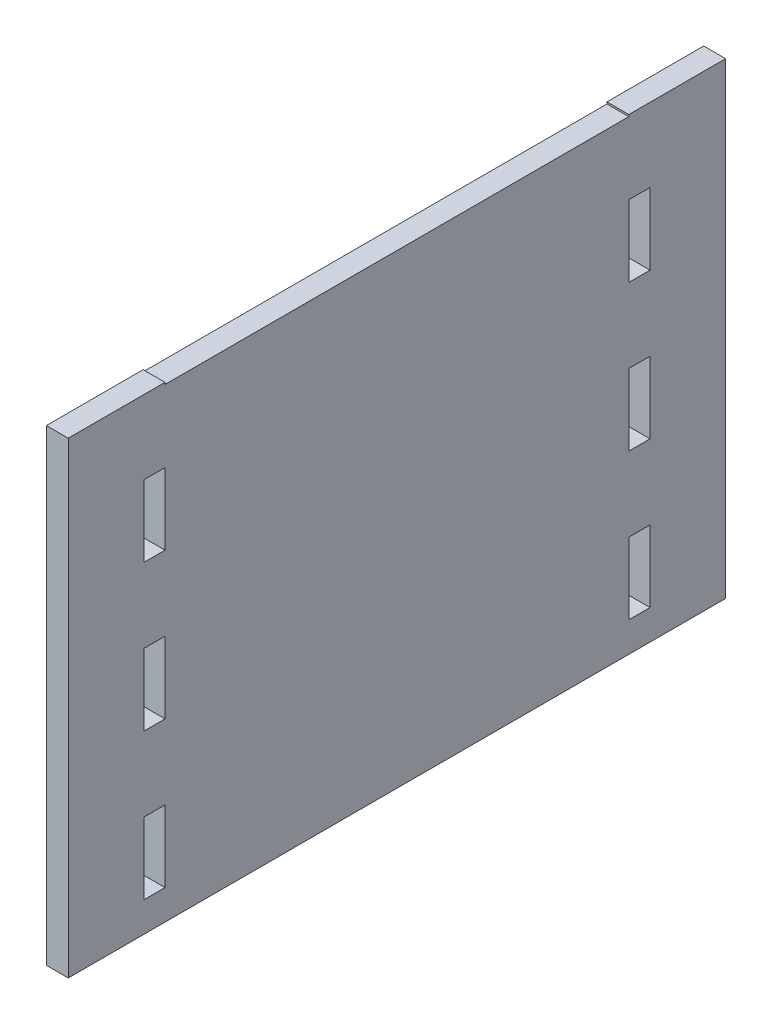
ISO-10303-21;
HEADER;
FILE_DESCRIPTION(('STEP AP214'),'2;1');
FILE_NAME('part.step','',(''),(''),'','','');
FILE_SCHEMA(('AUTOMOTIVE_DESIGN { 1 0 10303 214 1 1 1 1 }'));
ENDSEC;
DATA;
#1=APPLICATION_CONTEXT('core data for automotive mechanical design processes');
#2=APPLICATION_PROTOCOL_DEFINITION('international standard','automotive_design',2000,#1);
#3=PRODUCT_CONTEXT('',#1,'mechanical');
#4=PRODUCT('Part','Part','',(#3));
#5=PRODUCT_RELATED_PRODUCT_CATEGORY('part','',(#4));
#6=PRODUCT_DEFINITION_FORMATION('','',#4);
#7=PRODUCT_DEFINITION_CONTEXT('part definition',#1,'design');
#8=PRODUCT_DEFINITION('design','',#6,#7);
#9=PRODUCT_DEFINITION_SHAPE('','',#8);
#10=(LENGTH_UNIT() NAMED_UNIT(*) SI_UNIT(.MILLI.,.METRE.));
#11=(NAMED_UNIT(*) PLANE_ANGLE_UNIT() SI_UNIT($,.RADIAN.));
#12=(NAMED_UNIT(*) SI_UNIT($,.STERADIAN.) SOLID_ANGLE_UNIT());
#13=UNCERTAINTY_MEASURE_WITH_UNIT(LENGTH_MEASURE(1.E-05),#10,'distance_accuracy_value','');
#14=(GEOMETRIC_REPRESENTATION_CONTEXT(3) GLOBAL_UNCERTAINTY_ASSIGNED_CONTEXT((#13)) GLOBAL_UNIT_ASSIGNED_CONTEXT((#10,
#11,#12)) REPRESENTATION_CONTEXT('',''));
#15=CARTESIAN_POINT('',(0.,0.,0.));
#16=DIRECTION('',(0.,0.,1.));
#17=DIRECTION('',(1.,0.,0.));
#18=AXIS2_PLACEMENT_3D('',#15,#16,#17);
#19=CARTESIAN_POINT('',(3.,32.,-45.));
#20=DIRECTION('',(0.,-1.,0.));
#21=DIRECTION('',(0.,0.,-1.));
#22=AXIS2_PLACEMENT_3D('',#19,#20,#21);
#23=PLANE('',#22);
#24=DIRECTION('',(0.,0.,1.));
#25=VECTOR('',#24,1.);
#26=CARTESIAN_POINT('',(0.,32.,-45.));
#27=LINE('',#26,#25);
#28=CARTESIAN_POINT('',(0.,32.,-45.));
#29=VERTEX_POINT('',#28);
#30=CARTESIAN_POINT('',(0.,32.,-31.75));
#31=VERTEX_POINT('',#30);
#32=EDGE_CURVE('E261',#29,#31,#27,.T.);
#33=ORIENTED_EDGE('',*,*,#32,.T.);
#34=DIRECTION('',(1.,0.,0.));
#35=VECTOR('',#34,1.);
#36=CARTESIAN_POINT('',(-7.,32.,-31.75));
#37=LINE('',#36,#35);
#38=CARTESIAN_POINT('',(3.,32.,-31.75));
#39=VERTEX_POINT('',#38);
#40=EDGE_CURVE('E245',#31,#39,#37,.T.);
#41=ORIENTED_EDGE('',*,*,#40,.T.);
#42=DIRECTION('',(0.,0.,1.));
#43=VECTOR('',#42,1.);
#44=CARTESIAN_POINT('',(3.,32.,-45.));
#45=LINE('',#44,#43);
#46=CARTESIAN_POINT('',(3.,32.,-45.));
#47=VERTEX_POINT('',#46);
#48=EDGE_CURVE('E259',#47,#39,#45,.T.);
#49=ORIENTED_EDGE('',*,*,#48,.F.);
#50=DIRECTION('',(-1.,0.,0.));
#51=VECTOR('',#50,1.);
#52=CARTESIAN_POINT('',(3.,32.,-45.));
#53=LINE('',#52,#51);
#54=EDGE_CURVE('E293',#47,#29,#53,.T.);
#55=ORIENTED_EDGE('',*,*,#54,.T.);
#56=EDGE_LOOP('',(#33,#41,#49,#55));
#57=FACE_BOUND('',#56,.T.);
#58=ADVANCED_FACE('F35',(#57),#23,.F.);
#59=CARTESIAN_POINT('',(3.,-32.,-45.));
#60=DIRECTION('',(0.,-1.,0.));
#61=DIRECTION('',(0.,0.,-1.));
#62=AXIS2_PLACEMENT_3D('',#59,#60,#61);
#63=PLANE('',#62);
#64=DIRECTION('',(0.,0.,1.));
#65=VECTOR('',#64,1.);
#66=CARTESIAN_POINT('',(0.,-32.,-45.));
#67=LINE('',#66,#65);
#68=CARTESIAN_POINT('',(0.,-32.,-45.));
#69=VERTEX_POINT('',#68);
#70=CARTESIAN_POINT('',(0.,-32.,45.));
#71=VERTEX_POINT('',#70);
#72=EDGE_CURVE('E278',#69,#71,#67,.T.);
#73=ORIENTED_EDGE('',*,*,#72,.F.);
#74=DIRECTION('',(-1.,0.,0.));
#75=VECTOR('',#74,1.);
#76=CARTESIAN_POINT('',(3.,-32.,-45.));
#77=LINE('',#76,#75);
#78=CARTESIAN_POINT('',(3.,-32.,-45.));
#79=VERTEX_POINT('',#78);
#80=EDGE_CURVE('E290',#79,#69,#77,.T.);
#81=ORIENTED_EDGE('',*,*,#80,.F.);
#82=DIRECTION('',(0.,0.,1.));
#83=VECTOR('',#82,1.);
#84=CARTESIAN_POINT('',(3.,-32.,-45.));
#85=LINE('',#84,#83);
#86=CARTESIAN_POINT('',(3.,-32.,45.));
#87=VERTEX_POINT('',#86);
#88=EDGE_CURVE('E289',#79,#87,#85,.T.);
#89=ORIENTED_EDGE('',*,*,#88,.T.);
#90=DIRECTION('',(-1.,0.,0.));
#91=VECTOR('',#90,1.);
#92=CARTESIAN_POINT('',(3.,-32.,45.));
#93=LINE('',#92,#91);
#94=EDGE_CURVE('E272',#87,#71,#93,.T.);
#95=ORIENTED_EDGE('',*,*,#94,.T.);
#96=EDGE_LOOP('',(#73,#81,#89,#95));
#97=FACE_BOUND('',#96,.T.);
#98=ADVANCED_FACE('F37',(#97),#63,.T.);
#99=CARTESIAN_POINT('',(3.,-32.,-45.));
#100=DIRECTION('',(0.,0.,1.));
#101=DIRECTION('',(1.,0.,0.));
#102=AXIS2_PLACEMENT_3D('',#99,#100,#101);
#103=PLANE('',#102);
#104=DIRECTION('',(0.,1.,0.));
#105=VECTOR('',#104,1.);
#106=CARTESIAN_POINT('',(0.,-32.,-45.));
#107=LINE('',#106,#105);
#108=EDGE_CURVE('E287',#69,#29,#107,.T.);
#109=ORIENTED_EDGE('',*,*,#108,.T.);
#110=ORIENTED_EDGE('',*,*,#54,.F.);
#111=DIRECTION('',(0.,1.,0.));
#112=VECTOR('',#111,1.);
#113=CARTESIAN_POINT('',(3.,-32.,-45.));
#114=LINE('',#113,#112);
#115=EDGE_CURVE('E268',#79,#47,#114,.T.);
#116=ORIENTED_EDGE('',*,*,#115,.F.);
#117=ORIENTED_EDGE('',*,*,#80,.T.);
#118=EDGE_LOOP('',(#109,#110,#116,#117));
#119=FACE_BOUND('',#118,.T.);
#120=ADVANCED_FACE('F518',(#119),#103,.F.);
#121=CARTESIAN_POINT('',(3.,32.,31.75));
#122=VERTEX_POINT('',#121);
#123=CARTESIAN_POINT('',(3.,32.,45.));
#124=VERTEX_POINT('',#123);
#125=EDGE_CURVE('E270',#122,#124,#45,.T.);
#126=ORIENTED_EDGE('',*,*,#125,.F.);
#127=DIRECTION('',(1.,0.,0.));
#128=VECTOR('',#127,1.);
#129=CARTESIAN_POINT('',(-7.,32.,31.75));
#130=LINE('',#129,#128);
#131=CARTESIAN_POINT('',(0.,32.,31.75));
#132=VERTEX_POINT('',#131);
#133=EDGE_CURVE('E262',#132,#122,#130,.T.);
#134=ORIENTED_EDGE('',*,*,#133,.F.);
#135=CARTESIAN_POINT('',(0.,32.,45.));
#136=VERTEX_POINT('',#135);
#137=EDGE_CURVE('E285',#132,#136,#27,.T.);
#138=ORIENTED_EDGE('',*,*,#137,.T.);
#139=DIRECTION('',(-1.,0.,0.));
#140=VECTOR('',#139,1.);
#141=CARTESIAN_POINT('',(3.,32.,45.));
#142=LINE('',#141,#140);
#143=EDGE_CURVE('E295',#124,#136,#142,.T.);
#144=ORIENTED_EDGE('',*,*,#143,.F.);
#145=EDGE_LOOP('',(#126,#134,#138,#144));
#146=FACE_BOUND('',#145,.T.);
#147=ADVANCED_FACE('F312',(#146),#23,.F.);
#148=CARTESIAN_POINT('',(3.,-32.,45.));
#149=DIRECTION('',(0.,0.,1.));
#150=DIRECTION('',(1.,0.,0.));
#151=AXIS2_PLACEMENT_3D('',#148,#149,#150);
#152=PLANE('',#151);
#153=DIRECTION('',(0.,1.,0.));
#154=VECTOR('',#153,1.);
#155=CARTESIAN_POINT('',(0.,-32.,45.));
#156=LINE('',#155,#154);
#157=EDGE_CURVE('E281',#71,#136,#156,.T.);
#158=ORIENTED_EDGE('',*,*,#157,.F.);
#159=ORIENTED_EDGE('',*,*,#94,.F.);
#160=DIRECTION('',(0.,1.,0.));
#161=VECTOR('',#160,1.);
#162=CARTESIAN_POINT('',(3.,-32.,45.));
#163=LINE('',#162,#161);
#164=EDGE_CURVE('E274',#87,#124,#163,.T.);
#165=ORIENTED_EDGE('',*,*,#164,.T.);
#166=ORIENTED_EDGE('',*,*,#143,.T.);
#167=EDGE_LOOP('',(#158,#159,#165,#166));
#168=FACE_BOUND('',#167,.T.);
#169=ADVANCED_FACE('F512',(#168),#152,.T.);
#170=CARTESIAN_POINT('',(3.,0.,0.));
#171=DIRECTION('',(-1.,0.,0.));
#172=DIRECTION('',(0.,0.,1.));
#173=AXIS2_PLACEMENT_3D('',#170,#171,#172);
#174=PLANE('',#173);
#175=DIRECTION('',(0.,0.,-1.));
#176=VECTOR('',#175,1.);
#177=CARTESIAN_POINT('',(3.,12.1,-31.75));
#178=LINE('',#177,#176);
#179=CARTESIAN_POINT('',(3.,12.1,-31.75));
#180=VERTEX_POINT('',#179);
#181=CARTESIAN_POINT('',(3.,12.1,-34.65));
#182=VERTEX_POINT('',#181);
#183=EDGE_CURVE('E463',#180,#182,#178,.T.);
#184=ORIENTED_EDGE('',*,*,#183,.F.);
#185=DIRECTION('',(0.,-1.,0.));
#186=VECTOR('',#185,1.);
#187=CARTESIAN_POINT('',(3.,21.9,-31.75));
#188=LINE('',#187,#186);
#189=CARTESIAN_POINT('',(3.,21.9,-31.75));
#190=VERTEX_POINT('',#189);
#191=EDGE_CURVE('E58',#190,#180,#188,.T.);
#192=ORIENTED_EDGE('',*,*,#191,.F.);
#193=DIRECTION('',(0.,0.,1.));
#194=VECTOR('',#193,1.);
#195=CARTESIAN_POINT('',(3.,21.9,-31.75));
#196=LINE('',#195,#194);
#197=CARTESIAN_POINT('',(3.,21.9,-34.65));
#198=VERTEX_POINT('',#197);
#199=EDGE_CURVE('E452',#198,#190,#196,.T.);
#200=ORIENTED_EDGE('',*,*,#199,.F.);
#201=DIRECTION('',(0.,1.,0.));
#202=VECTOR('',#201,1.);
#203=CARTESIAN_POINT('',(3.,21.9,-34.65));
#204=LINE('',#203,#202);
#205=EDGE_CURVE('E466',#182,#198,#204,.T.);
#206=ORIENTED_EDGE('',*,*,#205,.F.);
#207=EDGE_LOOP('',(#184,#192,#200,#206));
#208=FACE_BOUND('',#207,.T.);
#209=DIRECTION('',(0.,0.,-1.));
#210=VECTOR('',#209,1.);
#211=CARTESIAN_POINT('',(3.,-7.89999999999999,-31.7499999999998));
#212=LINE('',#211,#210);
#213=CARTESIAN_POINT('',(3.,-7.89999999999999,-31.7499999999998));
#214=VERTEX_POINT('',#213);
#215=CARTESIAN_POINT('',(3.,-7.89999999999999,-34.6499999999998));
#216=VERTEX_POINT('',#215);
#217=EDGE_CURVE('E432',#214,#216,#212,.T.);
#218=ORIENTED_EDGE('',*,*,#217,.F.);
#219=DIRECTION('',(0.,-1.,0.));
#220=VECTOR('',#219,1.);
#221=CARTESIAN_POINT('',(3.,1.90000000000001,-31.7499999999998));
#222=LINE('',#221,#220);
#223=CARTESIAN_POINT('',(3.,1.90000000000001,-31.7499999999998));
#224=VERTEX_POINT('',#223);
#225=EDGE_CURVE('E430',#224,#214,#222,.T.);
#226=ORIENTED_EDGE('',*,*,#225,.F.);
#227=DIRECTION('',(0.,0.,1.));
#228=VECTOR('',#227,1.);
#229=CARTESIAN_POINT('',(3.,1.90000000000001,-31.7499999999998));
#230=LINE('',#229,#228);
#231=CARTESIAN_POINT('',(3.,1.90000000000001,-34.6499999999998));
#232=VERTEX_POINT('',#231);
#233=EDGE_CURVE('E420',#232,#224,#230,.T.);
#234=ORIENTED_EDGE('',*,*,#233,.F.);
#235=DIRECTION('',(0.,1.,0.));
#236=VECTOR('',#235,1.);
#237=CARTESIAN_POINT('',(3.,1.90000000000001,-34.6499999999998));
#238=LINE('',#237,#236);
#239=EDGE_CURVE('E436',#216,#232,#238,.T.);
#240=ORIENTED_EDGE('',*,*,#239,.F.);
#241=EDGE_LOOP('',(#218,#226,#234,#240));
#242=FACE_BOUND('',#241,.T.);
#243=DIRECTION('',(0.,0.,-1.));
#244=VECTOR('',#243,1.);
#245=CARTESIAN_POINT('',(3.,-27.9,-31.7499999999996));
#246=LINE('',#245,#244);
#247=CARTESIAN_POINT('',(3.,-27.9,-31.7499999999996));
#248=VERTEX_POINT('',#247);
#249=CARTESIAN_POINT('',(3.,-27.9,-34.6499999999996));
#250=VERTEX_POINT('',#249);
#251=EDGE_CURVE('E400',#248,#250,#246,.T.);
#252=ORIENTED_EDGE('',*,*,#251,.F.);
#253=DIRECTION('',(0.,-1.,0.));
#254=VECTOR('',#253,1.);
#255=CARTESIAN_POINT('',(3.,-18.1,-31.7499999999996));
#256=LINE('',#255,#254);
#257=CARTESIAN_POINT('',(3.,-18.1,-31.7499999999996));
#258=VERTEX_POINT('',#257);
#259=EDGE_CURVE('E398',#258,#248,#256,.T.);
#260=ORIENTED_EDGE('',*,*,#259,.F.);
#261=DIRECTION('',(0.,0.,1.));
#262=VECTOR('',#261,1.);
#263=CARTESIAN_POINT('',(3.,-18.1,-31.7499999999996));
#264=LINE('',#263,#262);
#265=CARTESIAN_POINT('',(3.,-18.1,-34.6499999999996));
#266=VERTEX_POINT('',#265);
#267=EDGE_CURVE('E388',#266,#258,#264,.T.);
#268=ORIENTED_EDGE('',*,*,#267,.F.);
#269=DIRECTION('',(0.,1.,0.));
#270=VECTOR('',#269,1.);
#271=CARTESIAN_POINT('',(3.,-18.1,-34.6499999999996));
#272=LINE('',#271,#270);
#273=EDGE_CURVE('E404',#250,#266,#272,.T.);
#274=ORIENTED_EDGE('',*,*,#273,.F.);
#275=EDGE_LOOP('',(#252,#260,#268,#274));
#276=FACE_BOUND('',#275,.T.);
#277=DIRECTION('',(0.,-1.,0.));
#278=VECTOR('',#277,1.);
#279=CARTESIAN_POINT('',(3.,-18.1,34.6499999999996));
#280=LINE('',#279,#278);
#281=CARTESIAN_POINT('',(3.,-18.1,34.6499999999996));
#282=VERTEX_POINT('',#281);
#283=CARTESIAN_POINT('',(3.,-27.9,34.6499999999996));
#284=VERTEX_POINT('',#283);
#285=EDGE_CURVE('E368',#282,#284,#280,.T.);
#286=ORIENTED_EDGE('',*,*,#285,.F.);
#287=DIRECTION('',(0.,0.,1.));
#288=VECTOR('',#287,1.);
#289=CARTESIAN_POINT('',(3.,-18.1,31.7499999999996));
#290=LINE('',#289,#288);
#291=CARTESIAN_POINT('',(3.,-18.1,31.7499999999996));
#292=VERTEX_POINT('',#291);
#293=EDGE_CURVE('E366',#292,#282,#290,.T.);
#294=ORIENTED_EDGE('',*,*,#293,.F.);
#295=DIRECTION('',(0.,1.,0.));
#296=VECTOR('',#295,1.);
#297=CARTESIAN_POINT('',(3.,-18.1,31.7499999999996));
#298=LINE('',#297,#296);
#299=CARTESIAN_POINT('',(3.,-27.9,31.7499999999996));
#300=VERTEX_POINT('',#299);
#301=EDGE_CURVE('E356',#300,#292,#298,.T.);
#302=ORIENTED_EDGE('',*,*,#301,.F.);
#303=DIRECTION('',(0.,0.,-1.));
#304=VECTOR('',#303,1.);
#305=CARTESIAN_POINT('',(3.,-27.9,31.7499999999996));
#306=LINE('',#305,#304);
#307=EDGE_CURVE('E372',#284,#300,#306,.T.);
#308=ORIENTED_EDGE('',*,*,#307,.F.);
#309=EDGE_LOOP('',(#286,#294,#302,#308));
#310=FACE_BOUND('',#309,.T.);
#311=DIRECTION('',(0.,-1.,0.));
#312=VECTOR('',#311,1.);
#313=CARTESIAN_POINT('',(3.,1.90000000000001,34.6499999999998));
#314=LINE('',#313,#312);
#315=CARTESIAN_POINT('',(3.,1.90000000000001,34.6499999999998));
#316=VERTEX_POINT('',#315);
#317=CARTESIAN_POINT('',(3.,-7.89999999999999,34.6499999999998));
#318=VERTEX_POINT('',#317);
#319=EDGE_CURVE('E334',#316,#318,#314,.T.);
#320=ORIENTED_EDGE('',*,*,#319,.F.);
#321=DIRECTION('',(0.,0.,1.));
#322=VECTOR('',#321,1.);
#323=CARTESIAN_POINT('',(3.,1.90000000000001,31.7499999999998));
#324=LINE('',#323,#322);
#325=CARTESIAN_POINT('',(3.,1.90000000000001,31.7499999999998));
#326=VERTEX_POINT('',#325);
#327=EDGE_CURVE('E332',#326,#316,#324,.T.);
#328=ORIENTED_EDGE('',*,*,#327,.F.);
#329=DIRECTION('',(0.,1.,0.));
#330=VECTOR('',#329,1.);
#331=CARTESIAN_POINT('',(3.,1.90000000000001,31.7499999999998));
#332=LINE('',#331,#330);
#333=CARTESIAN_POINT('',(3.,-7.89999999999999,31.7499999999998));
#334=VERTEX_POINT('',#333);
#335=EDGE_CURVE('E322',#334,#326,#332,.T.);
#336=ORIENTED_EDGE('',*,*,#335,.F.);
#337=DIRECTION('',(0.,0.,-1.));
#338=VECTOR('',#337,1.);
#339=CARTESIAN_POINT('',(3.,-7.89999999999999,31.7499999999998));
#340=LINE('',#339,#338);
#341=EDGE_CURVE('E338',#318,#334,#340,.T.);
#342=ORIENTED_EDGE('',*,*,#341,.F.);
#343=EDGE_LOOP('',(#320,#328,#336,#342));
#344=FACE_BOUND('',#343,.T.);
#345=DIRECTION('',(0.,0.,1.));
#346=VECTOR('',#345,1.);
#347=CARTESIAN_POINT('',(3.,21.9,31.75));
#348=LINE('',#347,#346);
#349=CARTESIAN_POINT('',(3.,21.9,31.75));
#350=VERTEX_POINT('',#349);
#351=CARTESIAN_POINT('',(3.,21.9,34.65));
#352=VERTEX_POINT('',#351);
#353=EDGE_CURVE('E492',#350,#352,#348,.T.);
#354=ORIENTED_EDGE('',*,*,#353,.F.);
#355=DIRECTION('',(0.,1.,0.));
#356=VECTOR('',#355,1.);
#357=CARTESIAN_POINT('',(3.,21.9,31.75));
#358=LINE('',#357,#356);
#359=CARTESIAN_POINT('',(3.,12.1,31.75));
#360=VERTEX_POINT('',#359);
#361=EDGE_CURVE('E345',#360,#350,#358,.T.);
#362=ORIENTED_EDGE('',*,*,#361,.F.);
#363=DIRECTION('',(0.,0.,-1.));
#364=VECTOR('',#363,1.);
#365=CARTESIAN_POINT('',(3.,12.1,31.75));
#366=LINE('',#365,#364);
#367=CARTESIAN_POINT('',(3.,12.1,34.65));
#368=VERTEX_POINT('',#367);
#369=EDGE_CURVE('E481',#368,#360,#366,.T.);
#370=ORIENTED_EDGE('',*,*,#369,.F.);
#371=DIRECTION('',(0.,-1.,0.));
#372=VECTOR('',#371,1.);
#373=CARTESIAN_POINT('',(3.,21.9,34.65));
#374=LINE('',#373,#372);
#375=EDGE_CURVE('E495',#352,#368,#374,.T.);
#376=ORIENTED_EDGE('',*,*,#375,.F.);
#377=EDGE_LOOP('',(#354,#362,#370,#376));
#378=FACE_BOUND('',#377,.T.);
#379=ORIENTED_EDGE('',*,*,#48,.T.);
#380=DIRECTION('',(0.,1.,0.));
#381=VECTOR('',#380,1.);
#382=CARTESIAN_POINT('',(3.,32.,-31.75));
#383=LINE('',#382,#381);
#384=CARTESIAN_POINT('',(3.,31.75,-31.75));
#385=VERTEX_POINT('',#384);
#386=EDGE_CURVE('E242',#385,#39,#383,.T.);
#387=ORIENTED_EDGE('',*,*,#386,.F.);
#388=DIRECTION('',(0.,0.,-1.));
#389=VECTOR('',#388,1.);
#390=CARTESIAN_POINT('',(3.,31.75,31.75));
#391=LINE('',#390,#389);
#392=CARTESIAN_POINT('',(3.,31.75,31.75));
#393=VERTEX_POINT('',#392);
#394=EDGE_CURVE('E263',#393,#385,#391,.T.);
#395=ORIENTED_EDGE('',*,*,#394,.F.);
#396=DIRECTION('',(0.,-1.,0.));
#397=VECTOR('',#396,1.);
#398=CARTESIAN_POINT('',(3.,32.,31.75));
#399=LINE('',#398,#397);
#400=EDGE_CURVE('E253',#122,#393,#399,.T.);
#401=ORIENTED_EDGE('',*,*,#400,.F.);
#402=ORIENTED_EDGE('',*,*,#125,.T.);
#403=ORIENTED_EDGE('',*,*,#164,.F.);
#404=ORIENTED_EDGE('',*,*,#88,.F.);
#405=ORIENTED_EDGE('',*,*,#115,.T.);
#406=EDGE_LOOP('',(#379,#387,#395,#401,#402,#403,#404,#405));
#407=FACE_BOUND('',#406,.T.);
#408=ADVANCED_FACE('F265',(#208,#242,#276,#310,#344,#378,#407),#174,.F.);
#409=CARTESIAN_POINT('',(0.,0.,0.));
#410=DIRECTION('',(-1.,0.,0.));
#411=DIRECTION('',(0.,0.,1.));
#412=AXIS2_PLACEMENT_3D('',#409,#410,#411);
#413=PLANE('',#412);
#414=DIRECTION('',(0.,-1.,0.));
#415=VECTOR('',#414,1.);
#416=CARTESIAN_POINT('',(0.,0.,-31.75));
#417=LINE('',#416,#415);
#418=CARTESIAN_POINT('',(0.,31.75,-31.75));
#419=VERTEX_POINT('',#418);
#420=EDGE_CURVE('E11',#31,#419,#417,.T.);
#421=ORIENTED_EDGE('',*,*,#420,.F.);
#422=ORIENTED_EDGE('',*,*,#32,.F.);
#423=ORIENTED_EDGE('',*,*,#108,.F.);
#424=ORIENTED_EDGE('',*,*,#72,.T.);
#425=ORIENTED_EDGE('',*,*,#157,.T.);
#426=ORIENTED_EDGE('',*,*,#137,.F.);
#427=DIRECTION('',(0.,1.,0.));
#428=VECTOR('',#427,1.);
#429=CARTESIAN_POINT('',(0.,0.,31.75));
#430=LINE('',#429,#428);
#431=CARTESIAN_POINT('',(0.,31.75,31.75));
#432=VERTEX_POINT('',#431);
#433=EDGE_CURVE('E292',#432,#132,#430,.T.);
#434=ORIENTED_EDGE('',*,*,#433,.F.);
#435=DIRECTION('',(0.,0.,1.));
#436=VECTOR('',#435,1.);
#437=CARTESIAN_POINT('',(0.,31.75,0.));
#438=LINE('',#437,#436);
#439=EDGE_CURVE('E43',#419,#432,#438,.T.);
#440=ORIENTED_EDGE('',*,*,#439,.F.);
#441=EDGE_LOOP('',(#421,#422,#423,#424,#425,#426,#434,#440));
#442=FACE_BOUND('',#441,.T.);
#443=DIRECTION('',(0.,-1.,0.));
#444=VECTOR('',#443,1.);
#445=CARTESIAN_POINT('',(0.,21.9,-31.75));
#446=LINE('',#445,#444);
#447=CARTESIAN_POINT('',(0.,21.9,-31.75));
#448=VERTEX_POINT('',#447);
#449=CARTESIAN_POINT('',(0.,12.1,-31.75));
#450=VERTEX_POINT('',#449);
#451=EDGE_CURVE('E448',#448,#450,#446,.T.);
#452=ORIENTED_EDGE('',*,*,#451,.T.);
#453=DIRECTION('',(0.,0.,-1.));
#454=VECTOR('',#453,1.);
#455=CARTESIAN_POINT('',(0.,12.1,-31.75));
#456=LINE('',#455,#454);
#457=CARTESIAN_POINT('',(0.,12.1,-34.65));
#458=VERTEX_POINT('',#457);
#459=EDGE_CURVE('E451',#450,#458,#456,.T.);
#460=ORIENTED_EDGE('',*,*,#459,.T.);
#461=DIRECTION('',(0.,1.,0.));
#462=VECTOR('',#461,1.);
#463=CARTESIAN_POINT('',(0.,21.9,-34.65));
#464=LINE('',#463,#462);
#465=CARTESIAN_POINT('',(0.,21.9,-34.65));
#466=VERTEX_POINT('',#465);
#467=EDGE_CURVE('E455',#458,#466,#464,.T.);
#468=ORIENTED_EDGE('',*,*,#467,.T.);
#469=DIRECTION('',(0.,0.,1.));
#470=VECTOR('',#469,1.);
#471=CARTESIAN_POINT('',(0.,21.9,-31.75));
#472=LINE('',#471,#470);
#473=EDGE_CURVE('E458',#466,#448,#472,.T.);
#474=ORIENTED_EDGE('',*,*,#473,.T.);
#475=EDGE_LOOP('',(#452,#460,#468,#474));
#476=FACE_BOUND('',#475,.T.);
#477=DIRECTION('',(0.,-1.,0.));
#478=VECTOR('',#477,1.);
#479=CARTESIAN_POINT('',(0.,1.90000000000001,-31.7499999999998));
#480=LINE('',#479,#478);
#481=CARTESIAN_POINT('',(0.,1.90000000000001,-31.7499999999998));
#482=VERTEX_POINT('',#481);
#483=CARTESIAN_POINT('',(0.,-7.89999999999999,-31.7499999999998));
#484=VERTEX_POINT('',#483);
#485=EDGE_CURVE('E416',#482,#484,#480,.T.);
#486=ORIENTED_EDGE('',*,*,#485,.T.);
#487=DIRECTION('',(0.,0.,-1.));
#488=VECTOR('',#487,1.);
#489=CARTESIAN_POINT('',(0.,-7.89999999999999,-31.7499999999998));
#490=LINE('',#489,#488);
#491=CARTESIAN_POINT('',(0.,-7.89999999999999,-34.6499999999998));
#492=VERTEX_POINT('',#491);
#493=EDGE_CURVE('E419',#484,#492,#490,.T.);
#494=ORIENTED_EDGE('',*,*,#493,.T.);
#495=DIRECTION('',(0.,1.,0.));
#496=VECTOR('',#495,1.);
#497=CARTESIAN_POINT('',(0.,1.90000000000001,-34.6499999999998));
#498=LINE('',#497,#496);
#499=CARTESIAN_POINT('',(0.,1.90000000000001,-34.6499999999998));
#500=VERTEX_POINT('',#499);
#501=EDGE_CURVE('E423',#492,#500,#498,.T.);
#502=ORIENTED_EDGE('',*,*,#501,.T.);
#503=DIRECTION('',(0.,0.,1.));
#504=VECTOR('',#503,1.);
#505=CARTESIAN_POINT('',(0.,1.90000000000001,-31.7499999999998));
#506=LINE('',#505,#504);
#507=EDGE_CURVE('E426',#500,#482,#506,.T.);
#508=ORIENTED_EDGE('',*,*,#507,.T.);
#509=EDGE_LOOP('',(#486,#494,#502,#508));
#510=FACE_BOUND('',#509,.T.);
#511=DIRECTION('',(0.,-1.,0.));
#512=VECTOR('',#511,1.);
#513=CARTESIAN_POINT('',(0.,-18.1,-31.7499999999996));
#514=LINE('',#513,#512);
#515=CARTESIAN_POINT('',(0.,-18.1,-31.7499999999996));
#516=VERTEX_POINT('',#515);
#517=CARTESIAN_POINT('',(0.,-27.9,-31.7499999999996));
#518=VERTEX_POINT('',#517);
#519=EDGE_CURVE('E384',#516,#518,#514,.T.);
#520=ORIENTED_EDGE('',*,*,#519,.T.);
#521=DIRECTION('',(0.,0.,-1.));
#522=VECTOR('',#521,1.);
#523=CARTESIAN_POINT('',(0.,-27.9,-31.7499999999996));
#524=LINE('',#523,#522);
#525=CARTESIAN_POINT('',(0.,-27.9,-34.6499999999996));
#526=VERTEX_POINT('',#525);
#527=EDGE_CURVE('E387',#518,#526,#524,.T.);
#528=ORIENTED_EDGE('',*,*,#527,.T.);
#529=DIRECTION('',(0.,1.,0.));
#530=VECTOR('',#529,1.);
#531=CARTESIAN_POINT('',(0.,-18.1,-34.6499999999996));
#532=LINE('',#531,#530);
#533=CARTESIAN_POINT('',(0.,-18.1,-34.6499999999996));
#534=VERTEX_POINT('',#533);
#535=EDGE_CURVE('E391',#526,#534,#532,.T.);
#536=ORIENTED_EDGE('',*,*,#535,.T.);
#537=DIRECTION('',(0.,0.,1.));
#538=VECTOR('',#537,1.);
#539=CARTESIAN_POINT('',(0.,-18.1,-31.7499999999996));
#540=LINE('',#539,#538);
#541=EDGE_CURVE('E394',#534,#516,#540,.T.);
#542=ORIENTED_EDGE('',*,*,#541,.T.);
#543=EDGE_LOOP('',(#520,#528,#536,#542));
#544=FACE_BOUND('',#543,.T.);
#545=DIRECTION('',(0.,0.,1.));
#546=VECTOR('',#545,1.);
#547=CARTESIAN_POINT('',(0.,-18.1,31.7499999999996));
#548=LINE('',#547,#546);
#549=CARTESIAN_POINT('',(0.,-18.1,31.7499999999996));
#550=VERTEX_POINT('',#549);
#551=CARTESIAN_POINT('',(0.,-18.1,34.6499999999996));
#552=VERTEX_POINT('',#551);
#553=EDGE_CURVE('E352',#550,#552,#548,.T.);
#554=ORIENTED_EDGE('',*,*,#553,.T.);
#555=DIRECTION('',(0.,-1.,0.));
#556=VECTOR('',#555,1.);
#557=CARTESIAN_POINT('',(0.,-18.1,34.6499999999996));
#558=LINE('',#557,#556);
#559=CARTESIAN_POINT('',(0.,-27.9,34.6499999999996));
#560=VERTEX_POINT('',#559);
#561=EDGE_CURVE('E355',#552,#560,#558,.T.);
#562=ORIENTED_EDGE('',*,*,#561,.T.);
#563=DIRECTION('',(0.,0.,-1.));
#564=VECTOR('',#563,1.);
#565=CARTESIAN_POINT('',(0.,-27.9,31.7499999999996));
#566=LINE('',#565,#564);
#567=CARTESIAN_POINT('',(0.,-27.9,31.7499999999996));
#568=VERTEX_POINT('',#567);
#569=EDGE_CURVE('E359',#560,#568,#566,.T.);
#570=ORIENTED_EDGE('',*,*,#569,.T.);
#571=DIRECTION('',(0.,1.,0.));
#572=VECTOR('',#571,1.);
#573=CARTESIAN_POINT('',(0.,-18.1,31.7499999999996));
#574=LINE('',#573,#572);
#575=EDGE_CURVE('E362',#568,#550,#574,.T.);
#576=ORIENTED_EDGE('',*,*,#575,.T.);
#577=EDGE_LOOP('',(#554,#562,#570,#576));
#578=FACE_BOUND('',#577,.T.);
#579=DIRECTION('',(0.,0.,1.));
#580=VECTOR('',#579,1.);
#581=CARTESIAN_POINT('',(0.,1.90000000000001,31.7499999999998));
#582=LINE('',#581,#580);
#583=CARTESIAN_POINT('',(0.,1.90000000000001,31.7499999999998));
#584=VERTEX_POINT('',#583);
#585=CARTESIAN_POINT('',(0.,1.90000000000001,34.6499999999998));
#586=VERTEX_POINT('',#585);
#587=EDGE_CURVE('E318',#584,#586,#582,.T.);
#588=ORIENTED_EDGE('',*,*,#587,.T.);
#589=DIRECTION('',(0.,-1.,0.));
#590=VECTOR('',#589,1.);
#591=CARTESIAN_POINT('',(0.,1.90000000000001,34.6499999999998));
#592=LINE('',#591,#590);
#593=CARTESIAN_POINT('',(0.,-7.89999999999999,34.6499999999998));
#594=VERTEX_POINT('',#593);
#595=EDGE_CURVE('E321',#586,#594,#592,.T.);
#596=ORIENTED_EDGE('',*,*,#595,.T.);
#597=DIRECTION('',(0.,0.,-1.));
#598=VECTOR('',#597,1.);
#599=CARTESIAN_POINT('',(0.,-7.89999999999999,31.7499999999998));
#600=LINE('',#599,#598);
#601=CARTESIAN_POINT('',(0.,-7.89999999999999,31.7499999999998));
#602=VERTEX_POINT('',#601);
#603=EDGE_CURVE('E325',#594,#602,#600,.T.);
#604=ORIENTED_EDGE('',*,*,#603,.T.);
#605=DIRECTION('',(0.,1.,0.));
#606=VECTOR('',#605,1.);
#607=CARTESIAN_POINT('',(0.,1.90000000000001,31.7499999999998));
#608=LINE('',#607,#606);
#609=EDGE_CURVE('E328',#602,#584,#608,.T.);
#610=ORIENTED_EDGE('',*,*,#609,.T.);
#611=EDGE_LOOP('',(#588,#596,#604,#610));
#612=FACE_BOUND('',#611,.T.);
#613=DIRECTION('',(0.,1.,0.));
#614=VECTOR('',#613,1.);
#615=CARTESIAN_POINT('',(0.,21.9,31.75));
#616=LINE('',#615,#614);
#617=CARTESIAN_POINT('',(0.,12.1,31.75));
#618=VERTEX_POINT('',#617);
#619=CARTESIAN_POINT('',(0.,21.9,31.75));
#620=VERTEX_POINT('',#619);
#621=EDGE_CURVE('E477',#618,#620,#616,.T.);
#622=ORIENTED_EDGE('',*,*,#621,.T.);
#623=DIRECTION('',(0.,0.,1.));
#624=VECTOR('',#623,1.);
#625=CARTESIAN_POINT('',(0.,21.9,31.75));
#626=LINE('',#625,#624);
#627=CARTESIAN_POINT('',(0.,21.9,34.65));
#628=VERTEX_POINT('',#627);
#629=EDGE_CURVE('E480',#620,#628,#626,.T.);
#630=ORIENTED_EDGE('',*,*,#629,.T.);
#631=DIRECTION('',(0.,-1.,0.));
#632=VECTOR('',#631,1.);
#633=CARTESIAN_POINT('',(0.,21.9,34.65));
#634=LINE('',#633,#632);
#635=CARTESIAN_POINT('',(0.,12.1,34.65));
#636=VERTEX_POINT('',#635);
#637=EDGE_CURVE('E484',#628,#636,#634,.T.);
#638=ORIENTED_EDGE('',*,*,#637,.T.);
#639=DIRECTION('',(0.,0.,-1.));
#640=VECTOR('',#639,1.);
#641=CARTESIAN_POINT('',(0.,12.1,31.75));
#642=LINE('',#641,#640);
#643=EDGE_CURVE('E487',#636,#618,#642,.T.);
#644=ORIENTED_EDGE('',*,*,#643,.T.);
#645=EDGE_LOOP('',(#622,#630,#638,#644));
#646=FACE_BOUND('',#645,.T.);
#647=ADVANCED_FACE('F305',(#442,#476,#510,#544,#578,#612,#646),#413,.T.);
#648=CARTESIAN_POINT('',(0.,21.9,31.75));
#649=DIRECTION('',(0.,0.,-1.));
#650=DIRECTION('',(-1.,0.,0.));
#651=AXIS2_PLACEMENT_3D('',#648,#649,#650);
#652=PLANE('',#651);
#653=ORIENTED_EDGE('',*,*,#361,.T.);
#654=DIRECTION('',(1.,0.,0.));
#655=VECTOR('',#654,1.);
#656=CARTESIAN_POINT('',(0.,21.9,31.75));
#657=LINE('',#656,#655);
#658=EDGE_CURVE('E490',#620,#350,#657,.T.);
#659=ORIENTED_EDGE('',*,*,#658,.F.);
#660=ORIENTED_EDGE('',*,*,#621,.F.);
#661=DIRECTION('',(1.,0.,0.));
#662=VECTOR('',#661,1.);
#663=CARTESIAN_POINT('',(0.,12.1,31.75));
#664=LINE('',#663,#662);
#665=EDGE_CURVE('E282',#618,#360,#664,.T.);
#666=ORIENTED_EDGE('',*,*,#665,.T.);
#667=EDGE_LOOP('',(#653,#659,#660,#666));
#668=FACE_BOUND('',#667,.T.);
#669=ADVANCED_FACE('F539',(#668),#652,.F.);
#670=CARTESIAN_POINT('',(0.,12.1,31.75));
#671=DIRECTION('',(0.,-1.,0.));
#672=DIRECTION('',(0.,0.,-1.));
#673=AXIS2_PLACEMENT_3D('',#670,#671,#672);
#674=PLANE('',#673);
#675=ORIENTED_EDGE('',*,*,#369,.T.);
#676=ORIENTED_EDGE('',*,*,#665,.F.);
#677=ORIENTED_EDGE('',*,*,#643,.F.);
#678=DIRECTION('',(1.,0.,0.));
#679=VECTOR('',#678,1.);
#680=CARTESIAN_POINT('',(0.,12.1,34.65));
#681=LINE('',#680,#679);
#682=EDGE_CURVE('E501',#636,#368,#681,.T.);
#683=ORIENTED_EDGE('',*,*,#682,.T.);
#684=EDGE_LOOP('',(#675,#676,#677,#683));
#685=FACE_BOUND('',#684,.T.);
#686=ADVANCED_FACE('F545',(#685),#674,.F.);
#687=CARTESIAN_POINT('',(0.,21.9,34.65));
#688=DIRECTION('',(0.,0.,1.));
#689=DIRECTION('',(1.,0.,0.));
#690=AXIS2_PLACEMENT_3D('',#687,#688,#689);
#691=PLANE('',#690);
#692=ORIENTED_EDGE('',*,*,#375,.T.);
#693=ORIENTED_EDGE('',*,*,#682,.F.);
#694=ORIENTED_EDGE('',*,*,#637,.F.);
#695=DIRECTION('',(1.,0.,0.));
#696=VECTOR('',#695,1.);
#697=CARTESIAN_POINT('',(0.,21.9,34.65));
#698=LINE('',#697,#696);
#699=EDGE_CURVE('E503',#628,#352,#698,.T.);
#700=ORIENTED_EDGE('',*,*,#699,.T.);
#701=EDGE_LOOP('',(#692,#693,#694,#700));
#702=FACE_BOUND('',#701,.T.);
#703=ADVANCED_FACE('F551',(#702),#691,.F.);
#704=CARTESIAN_POINT('',(0.,21.9,31.75));
#705=DIRECTION('',(0.,1.,0.));
#706=DIRECTION('',(0.,0.,1.));
#707=AXIS2_PLACEMENT_3D('',#704,#705,#706);
#708=PLANE('',#707);
#709=ORIENTED_EDGE('',*,*,#353,.T.);
#710=ORIENTED_EDGE('',*,*,#699,.F.);
#711=ORIENTED_EDGE('',*,*,#629,.F.);
#712=ORIENTED_EDGE('',*,*,#658,.T.);
#713=EDGE_LOOP('',(#709,#710,#711,#712));
#714=FACE_BOUND('',#713,.T.);
#715=ADVANCED_FACE('F547',(#714),#708,.F.);
#716=CARTESIAN_POINT('',(0.,1.90000000000001,31.7499999999998));
#717=DIRECTION('',(0.,1.,0.));
#718=DIRECTION('',(0.,0.,1.));
#719=AXIS2_PLACEMENT_3D('',#716,#717,#718);
#720=PLANE('',#719);
#721=ORIENTED_EDGE('',*,*,#327,.T.);
#722=DIRECTION('',(1.,0.,0.));
#723=VECTOR('',#722,1.);
#724=CARTESIAN_POINT('',(0.,1.90000000000001,34.6499999999998));
#725=LINE('',#724,#723);
#726=EDGE_CURVE('E331',#586,#316,#725,.T.);
#727=ORIENTED_EDGE('',*,*,#726,.F.);
#728=ORIENTED_EDGE('',*,*,#587,.F.);
#729=DIRECTION('',(1.,0.,0.));
#730=VECTOR('',#729,1.);
#731=CARTESIAN_POINT('',(0.,1.90000000000001,31.7499999999998));
#732=LINE('',#731,#730);
#733=EDGE_CURVE('E343',#584,#326,#732,.T.);
#734=ORIENTED_EDGE('',*,*,#733,.T.);
#735=EDGE_LOOP('',(#721,#727,#728,#734));
#736=FACE_BOUND('',#735,.T.);
#737=ADVANCED_FACE('F550',(#736),#720,.F.);
#738=CARTESIAN_POINT('',(0.,1.90000000000001,31.7499999999998));
#739=DIRECTION('',(0.,0.,-1.));
#740=DIRECTION('',(-1.,0.,0.));
#741=AXIS2_PLACEMENT_3D('',#738,#739,#740);
#742=PLANE('',#741);
#743=ORIENTED_EDGE('',*,*,#335,.T.);
#744=ORIENTED_EDGE('',*,*,#733,.F.);
#745=ORIENTED_EDGE('',*,*,#609,.F.);
#746=DIRECTION('',(1.,0.,0.));
#747=VECTOR('',#746,1.);
#748=CARTESIAN_POINT('',(0.,-7.89999999999999,31.7499999999998));
#749=LINE('',#748,#747);
#750=EDGE_CURVE('E346',#602,#334,#749,.T.);
#751=ORIENTED_EDGE('',*,*,#750,.T.);
#752=EDGE_LOOP('',(#743,#744,#745,#751));
#753=FACE_BOUND('',#752,.T.);
#754=ADVANCED_FACE('F625',(#753),#742,.F.);
#755=CARTESIAN_POINT('',(0.,-7.89999999999999,31.7499999999998));
#756=DIRECTION('',(0.,-1.,0.));
#757=DIRECTION('',(0.,0.,-1.));
#758=AXIS2_PLACEMENT_3D('',#755,#756,#757);
#759=PLANE('',#758);
#760=ORIENTED_EDGE('',*,*,#341,.T.);
#761=ORIENTED_EDGE('',*,*,#750,.F.);
#762=ORIENTED_EDGE('',*,*,#603,.F.);
#763=DIRECTION('',(1.,0.,0.));
#764=VECTOR('',#763,1.);
#765=CARTESIAN_POINT('',(0.,-7.89999999999999,34.6499999999998));
#766=LINE('',#765,#764);
#767=EDGE_CURVE('E348',#594,#318,#766,.T.);
#768=ORIENTED_EDGE('',*,*,#767,.T.);
#769=EDGE_LOOP('',(#760,#761,#762,#768));
#770=FACE_BOUND('',#769,.T.);
#771=ADVANCED_FACE('F629',(#770),#759,.F.);
#772=CARTESIAN_POINT('',(0.,1.90000000000001,34.6499999999998));
#773=DIRECTION('',(0.,0.,1.));
#774=DIRECTION('',(1.,0.,0.));
#775=AXIS2_PLACEMENT_3D('',#772,#773,#774);
#776=PLANE('',#775);
#777=ORIENTED_EDGE('',*,*,#319,.T.);
#778=ORIENTED_EDGE('',*,*,#767,.F.);
#779=ORIENTED_EDGE('',*,*,#595,.F.);
#780=ORIENTED_EDGE('',*,*,#726,.T.);
#781=EDGE_LOOP('',(#777,#778,#779,#780));
#782=FACE_BOUND('',#781,.T.);
#783=ADVANCED_FACE('F611',(#782),#776,.F.);
#784=CARTESIAN_POINT('',(0.,-18.1,31.7499999999996));
#785=DIRECTION('',(0.,1.,0.));
#786=DIRECTION('',(0.,0.,1.));
#787=AXIS2_PLACEMENT_3D('',#784,#785,#786);
#788=PLANE('',#787);
#789=ORIENTED_EDGE('',*,*,#293,.T.);
#790=DIRECTION('',(1.,0.,0.));
#791=VECTOR('',#790,1.);
#792=CARTESIAN_POINT('',(0.,-18.1,34.6499999999996));
#793=LINE('',#792,#791);
#794=EDGE_CURVE('E365',#552,#282,#793,.T.);
#795=ORIENTED_EDGE('',*,*,#794,.F.);
#796=ORIENTED_EDGE('',*,*,#553,.F.);
#797=DIRECTION('',(1.,0.,0.));
#798=VECTOR('',#797,1.);
#799=CARTESIAN_POINT('',(0.,-18.1,31.7499999999996));
#800=LINE('',#799,#798);
#801=EDGE_CURVE('E335',#550,#292,#800,.T.);
#802=ORIENTED_EDGE('',*,*,#801,.T.);
#803=EDGE_LOOP('',(#789,#795,#796,#802));
#804=FACE_BOUND('',#803,.T.);
#805=ADVANCED_FACE('F607',(#804),#788,.F.);
#806=CARTESIAN_POINT('',(0.,-18.1,31.7499999999996));
#807=DIRECTION('',(0.,0.,-1.));
#808=DIRECTION('',(-1.,0.,0.));
#809=AXIS2_PLACEMENT_3D('',#806,#807,#808);
#810=PLANE('',#809);
#811=ORIENTED_EDGE('',*,*,#301,.T.);
#812=ORIENTED_EDGE('',*,*,#801,.F.);
#813=ORIENTED_EDGE('',*,*,#575,.F.);
#814=DIRECTION('',(1.,0.,0.));
#815=VECTOR('',#814,1.);
#816=CARTESIAN_POINT('',(0.,-27.9,31.7499999999996));
#817=LINE('',#816,#815);
#818=EDGE_CURVE('E378',#568,#300,#817,.T.);
#819=ORIENTED_EDGE('',*,*,#818,.T.);
#820=EDGE_LOOP('',(#811,#812,#813,#819));
#821=FACE_BOUND('',#820,.T.);
#822=ADVANCED_FACE('F610',(#821),#810,.F.);
#823=CARTESIAN_POINT('',(0.,-27.9,31.7499999999996));
#824=DIRECTION('',(0.,-1.,0.));
#825=DIRECTION('',(0.,0.,-1.));
#826=AXIS2_PLACEMENT_3D('',#823,#824,#825);
#827=PLANE('',#826);
#828=ORIENTED_EDGE('',*,*,#307,.T.);
#829=ORIENTED_EDGE('',*,*,#818,.F.);
#830=ORIENTED_EDGE('',*,*,#569,.F.);
#831=DIRECTION('',(1.,0.,0.));
#832=VECTOR('',#831,1.);
#833=CARTESIAN_POINT('',(0.,-27.9,34.6499999999996));
#834=LINE('',#833,#832);
#835=EDGE_CURVE('E380',#560,#284,#834,.T.);
#836=ORIENTED_EDGE('',*,*,#835,.T.);
#837=EDGE_LOOP('',(#828,#829,#830,#836));
#838=FACE_BOUND('',#837,.T.);
#839=ADVANCED_FACE('F615',(#838),#827,.F.);
#840=CARTESIAN_POINT('',(0.,-18.1,34.6499999999996));
#841=DIRECTION('',(0.,0.,1.));
#842=DIRECTION('',(1.,0.,0.));
#843=AXIS2_PLACEMENT_3D('',#840,#841,#842);
#844=PLANE('',#843);
#845=ORIENTED_EDGE('',*,*,#285,.T.);
#846=ORIENTED_EDGE('',*,*,#835,.F.);
#847=ORIENTED_EDGE('',*,*,#561,.F.);
#848=ORIENTED_EDGE('',*,*,#794,.T.);
#849=EDGE_LOOP('',(#845,#846,#847,#848));
#850=FACE_BOUND('',#849,.T.);
#851=ADVANCED_FACE('F595',(#850),#844,.F.);
#852=CARTESIAN_POINT('',(0.,-18.1,-31.7499999999996));
#853=DIRECTION('',(0.,0.,1.));
#854=DIRECTION('',(1.,0.,0.));
#855=AXIS2_PLACEMENT_3D('',#852,#853,#854);
#856=PLANE('',#855);
#857=ORIENTED_EDGE('',*,*,#259,.T.);
#858=DIRECTION('',(1.,0.,0.));
#859=VECTOR('',#858,1.);
#860=CARTESIAN_POINT('',(0.,-27.9,-31.7499999999996));
#861=LINE('',#860,#859);
#862=EDGE_CURVE('E397',#518,#248,#861,.T.);
#863=ORIENTED_EDGE('',*,*,#862,.F.);
#864=ORIENTED_EDGE('',*,*,#519,.F.);
#865=DIRECTION('',(1.,0.,0.));
#866=VECTOR('',#865,1.);
#867=CARTESIAN_POINT('',(0.,-18.1,-31.7499999999996));
#868=LINE('',#867,#866);
#869=EDGE_CURVE('E369',#516,#258,#868,.T.);
#870=ORIENTED_EDGE('',*,*,#869,.T.);
#871=EDGE_LOOP('',(#857,#863,#864,#870));
#872=FACE_BOUND('',#871,.T.);
#873=ADVANCED_FACE('F591',(#872),#856,.F.);
#874=CARTESIAN_POINT('',(0.,-18.1,-31.7499999999996));
#875=DIRECTION('',(0.,1.,0.));
#876=DIRECTION('',(0.,0.,1.));
#877=AXIS2_PLACEMENT_3D('',#874,#875,#876);
#878=PLANE('',#877);
#879=ORIENTED_EDGE('',*,*,#267,.T.);
#880=ORIENTED_EDGE('',*,*,#869,.F.);
#881=ORIENTED_EDGE('',*,*,#541,.F.);
#882=DIRECTION('',(1.,0.,0.));
#883=VECTOR('',#882,1.);
#884=CARTESIAN_POINT('',(0.,-18.1,-34.6499999999996));
#885=LINE('',#884,#883);
#886=EDGE_CURVE('E410',#534,#266,#885,.T.);
#887=ORIENTED_EDGE('',*,*,#886,.T.);
#888=EDGE_LOOP('',(#879,#880,#881,#887));
#889=FACE_BOUND('',#888,.T.);
#890=ADVANCED_FACE('F594',(#889),#878,.F.);
#891=CARTESIAN_POINT('',(0.,-18.1,-34.6499999999996));
#892=DIRECTION('',(0.,0.,-1.));
#893=DIRECTION('',(-1.,0.,0.));
#894=AXIS2_PLACEMENT_3D('',#891,#892,#893);
#895=PLANE('',#894);
#896=ORIENTED_EDGE('',*,*,#273,.T.);
#897=ORIENTED_EDGE('',*,*,#886,.F.);
#898=ORIENTED_EDGE('',*,*,#535,.F.);
#899=DIRECTION('',(1.,0.,0.));
#900=VECTOR('',#899,1.);
#901=CARTESIAN_POINT('',(0.,-27.9,-34.6499999999996));
#902=LINE('',#901,#900);
#903=EDGE_CURVE('E412',#526,#250,#902,.T.);
#904=ORIENTED_EDGE('',*,*,#903,.T.);
#905=EDGE_LOOP('',(#896,#897,#898,#904));
#906=FACE_BOUND('',#905,.T.);
#907=ADVANCED_FACE('F599',(#906),#895,.F.);
#908=CARTESIAN_POINT('',(0.,-27.9,-31.7499999999996));
#909=DIRECTION('',(0.,-1.,0.));
#910=DIRECTION('',(0.,0.,-1.));
#911=AXIS2_PLACEMENT_3D('',#908,#909,#910);
#912=PLANE('',#911);
#913=ORIENTED_EDGE('',*,*,#251,.T.);
#914=ORIENTED_EDGE('',*,*,#903,.F.);
#915=ORIENTED_EDGE('',*,*,#527,.F.);
#916=ORIENTED_EDGE('',*,*,#862,.T.);
#917=EDGE_LOOP('',(#913,#914,#915,#916));
#918=FACE_BOUND('',#917,.T.);
#919=ADVANCED_FACE('F579',(#918),#912,.F.);
#920=CARTESIAN_POINT('',(0.,1.90000000000001,-31.7499999999998));
#921=DIRECTION('',(0.,0.,1.));
#922=DIRECTION('',(1.,0.,0.));
#923=AXIS2_PLACEMENT_3D('',#920,#921,#922);
#924=PLANE('',#923);
#925=ORIENTED_EDGE('',*,*,#225,.T.);
#926=DIRECTION('',(1.,0.,0.));
#927=VECTOR('',#926,1.);
#928=CARTESIAN_POINT('',(0.,-7.89999999999999,-31.7499999999998));
#929=LINE('',#928,#927);
#930=EDGE_CURVE('E429',#484,#214,#929,.T.);
#931=ORIENTED_EDGE('',*,*,#930,.F.);
#932=ORIENTED_EDGE('',*,*,#485,.F.);
#933=DIRECTION('',(1.,0.,0.));
#934=VECTOR('',#933,1.);
#935=CARTESIAN_POINT('',(0.,1.90000000000001,-31.7499999999998));
#936=LINE('',#935,#934);
#937=EDGE_CURVE('E401',#482,#224,#936,.T.);
#938=ORIENTED_EDGE('',*,*,#937,.T.);
#939=EDGE_LOOP('',(#925,#931,#932,#938));
#940=FACE_BOUND('',#939,.T.);
#941=ADVANCED_FACE('F575',(#940),#924,.F.);
#942=CARTESIAN_POINT('',(0.,1.90000000000001,-31.7499999999998));
#943=DIRECTION('',(0.,1.,0.));
#944=DIRECTION('',(0.,0.,1.));
#945=AXIS2_PLACEMENT_3D('',#942,#943,#944);
#946=PLANE('',#945);
#947=ORIENTED_EDGE('',*,*,#233,.T.);
#948=ORIENTED_EDGE('',*,*,#937,.F.);
#949=ORIENTED_EDGE('',*,*,#507,.F.);
#950=DIRECTION('',(1.,0.,0.));
#951=VECTOR('',#950,1.);
#952=CARTESIAN_POINT('',(0.,1.90000000000001,-34.6499999999998));
#953=LINE('',#952,#951);
#954=EDGE_CURVE('E442',#500,#232,#953,.T.);
#955=ORIENTED_EDGE('',*,*,#954,.T.);
#956=EDGE_LOOP('',(#947,#948,#949,#955));
#957=FACE_BOUND('',#956,.T.);
#958=ADVANCED_FACE('F578',(#957),#946,.F.);
#959=CARTESIAN_POINT('',(0.,1.90000000000001,-34.6499999999998));
#960=DIRECTION('',(0.,0.,-1.));
#961=DIRECTION('',(-1.,0.,0.));
#962=AXIS2_PLACEMENT_3D('',#959,#960,#961);
#963=PLANE('',#962);
#964=ORIENTED_EDGE('',*,*,#239,.T.);
#965=ORIENTED_EDGE('',*,*,#954,.F.);
#966=ORIENTED_EDGE('',*,*,#501,.F.);
#967=DIRECTION('',(1.,0.,0.));
#968=VECTOR('',#967,1.);
#969=CARTESIAN_POINT('',(0.,-7.89999999999999,-34.6499999999998));
#970=LINE('',#969,#968);
#971=EDGE_CURVE('E444',#492,#216,#970,.T.);
#972=ORIENTED_EDGE('',*,*,#971,.T.);
#973=EDGE_LOOP('',(#964,#965,#966,#972));
#974=FACE_BOUND('',#973,.T.);
#975=ADVANCED_FACE('F583',(#974),#963,.F.);
#976=CARTESIAN_POINT('',(0.,-7.89999999999999,-31.7499999999998));
#977=DIRECTION('',(0.,-1.,0.));
#978=DIRECTION('',(0.,0.,-1.));
#979=AXIS2_PLACEMENT_3D('',#976,#977,#978);
#980=PLANE('',#979);
#981=ORIENTED_EDGE('',*,*,#217,.T.);
#982=ORIENTED_EDGE('',*,*,#971,.F.);
#983=ORIENTED_EDGE('',*,*,#493,.F.);
#984=ORIENTED_EDGE('',*,*,#930,.T.);
#985=EDGE_LOOP('',(#981,#982,#983,#984));
#986=FACE_BOUND('',#985,.T.);
#987=ADVANCED_FACE('F563',(#986),#980,.F.);
#988=CARTESIAN_POINT('',(0.,21.9,-31.75));
#989=DIRECTION('',(0.,0.,1.));
#990=DIRECTION('',(1.,0.,0.));
#991=AXIS2_PLACEMENT_3D('',#988,#989,#990);
#992=PLANE('',#991);
#993=ORIENTED_EDGE('',*,*,#191,.T.);
#994=DIRECTION('',(1.,0.,0.));
#995=VECTOR('',#994,1.);
#996=CARTESIAN_POINT('',(0.,12.1,-31.75));
#997=LINE('',#996,#995);
#998=EDGE_CURVE('E461',#450,#180,#997,.T.);
#999=ORIENTED_EDGE('',*,*,#998,.F.);
#1000=ORIENTED_EDGE('',*,*,#451,.F.);
#1001=DIRECTION('',(1.,0.,0.));
#1002=VECTOR('',#1001,1.);
#1003=CARTESIAN_POINT('',(0.,21.9,-31.75));
#1004=LINE('',#1003,#1002);
#1005=EDGE_CURVE('E433',#448,#190,#1004,.T.);
#1006=ORIENTED_EDGE('',*,*,#1005,.T.);
#1007=EDGE_LOOP('',(#993,#999,#1000,#1006));
#1008=FACE_BOUND('',#1007,.T.);
#1009=ADVANCED_FACE('F559',(#1008),#992,.F.);
#1010=CARTESIAN_POINT('',(0.,21.9,-31.75));
#1011=DIRECTION('',(0.,1.,0.));
#1012=DIRECTION('',(0.,0.,1.));
#1013=AXIS2_PLACEMENT_3D('',#1010,#1011,#1012);
#1014=PLANE('',#1013);
#1015=ORIENTED_EDGE('',*,*,#199,.T.);
#1016=ORIENTED_EDGE('',*,*,#1005,.F.);
#1017=ORIENTED_EDGE('',*,*,#473,.F.);
#1018=DIRECTION('',(1.,0.,0.));
#1019=VECTOR('',#1018,1.);
#1020=CARTESIAN_POINT('',(0.,21.9,-34.65));
#1021=LINE('',#1020,#1019);
#1022=EDGE_CURVE('E472',#466,#198,#1021,.T.);
#1023=ORIENTED_EDGE('',*,*,#1022,.T.);
#1024=EDGE_LOOP('',(#1015,#1016,#1017,#1023));
#1025=FACE_BOUND('',#1024,.T.);
#1026=ADVANCED_FACE('F562',(#1025),#1014,.F.);
#1027=CARTESIAN_POINT('',(0.,21.9,-34.65));
#1028=DIRECTION('',(0.,0.,-1.));
#1029=DIRECTION('',(-1.,0.,0.));
#1030=AXIS2_PLACEMENT_3D('',#1027,#1028,#1029);
#1031=PLANE('',#1030);
#1032=ORIENTED_EDGE('',*,*,#205,.T.);
#1033=ORIENTED_EDGE('',*,*,#1022,.F.);
#1034=ORIENTED_EDGE('',*,*,#467,.F.);
#1035=DIRECTION('',(1.,0.,0.));
#1036=VECTOR('',#1035,1.);
#1037=CARTESIAN_POINT('',(0.,12.1,-34.65));
#1038=LINE('',#1037,#1036);
#1039=EDGE_CURVE('E474',#458,#182,#1038,.T.);
#1040=ORIENTED_EDGE('',*,*,#1039,.T.);
#1041=EDGE_LOOP('',(#1032,#1033,#1034,#1040));
#1042=FACE_BOUND('',#1041,.T.);
#1043=ADVANCED_FACE('F567',(#1042),#1031,.F.);
#1044=CARTESIAN_POINT('',(0.,12.1,-31.75));
#1045=DIRECTION('',(0.,-1.,0.));
#1046=DIRECTION('',(0.,0.,-1.));
#1047=AXIS2_PLACEMENT_3D('',#1044,#1045,#1046);
#1048=PLANE('',#1047);
#1049=ORIENTED_EDGE('',*,*,#183,.T.);
#1050=ORIENTED_EDGE('',*,*,#1039,.F.);
#1051=ORIENTED_EDGE('',*,*,#459,.F.);
#1052=ORIENTED_EDGE('',*,*,#998,.T.);
#1053=EDGE_LOOP('',(#1049,#1050,#1051,#1052));
#1054=FACE_BOUND('',#1053,.T.);
#1055=ADVANCED_FACE('F564',(#1054),#1048,.F.);
#1056=CARTESIAN_POINT('',(-7.,32.,-31.75));
#1057=DIRECTION('',(0.,0.,-1.));
#1058=DIRECTION('',(-1.,0.,0.));
#1059=AXIS2_PLACEMENT_3D('',#1056,#1057,#1058);
#1060=PLANE('',#1059);
#1061=ORIENTED_EDGE('',*,*,#420,.T.);
#1062=DIRECTION('',(1.,0.,0.));
#1063=VECTOR('',#1062,1.);
#1064=CARTESIAN_POINT('',(-7.,31.75,-31.75));
#1065=LINE('',#1064,#1063);
#1066=EDGE_CURVE('E248',#419,#385,#1065,.T.);
#1067=ORIENTED_EDGE('',*,*,#1066,.T.);
#1068=ORIENTED_EDGE('',*,*,#386,.T.);
#1069=ORIENTED_EDGE('',*,*,#40,.F.);
#1070=EDGE_LOOP('',(#1061,#1067,#1068,#1069));
#1071=FACE_BOUND('',#1070,.T.);
#1072=ADVANCED_FACE('F244',(#1071),#1060,.F.);
#1073=CARTESIAN_POINT('',(-7.,31.75,31.75));
#1074=DIRECTION('',(0.,-1.,0.));
#1075=DIRECTION('',(0.,0.,-1.));
#1076=AXIS2_PLACEMENT_3D('',#1073,#1074,#1075);
#1077=PLANE('',#1076);
#1078=ORIENTED_EDGE('',*,*,#439,.T.);
#1079=DIRECTION('',(1.,0.,0.));
#1080=VECTOR('',#1079,1.);
#1081=CARTESIAN_POINT('',(-7.,31.75,31.75));
#1082=LINE('',#1081,#1080);
#1083=EDGE_CURVE('E50',#432,#393,#1082,.T.);
#1084=ORIENTED_EDGE('',*,*,#1083,.T.);
#1085=ORIENTED_EDGE('',*,*,#394,.T.);
#1086=ORIENTED_EDGE('',*,*,#1066,.F.);
#1087=EDGE_LOOP('',(#1078,#1084,#1085,#1086));
#1088=FACE_BOUND('',#1087,.T.);
#1089=ADVANCED_FACE('F302',(#1088),#1077,.F.);
#1090=CARTESIAN_POINT('',(-7.,32.,31.75));
#1091=DIRECTION('',(0.,0.,1.));
#1092=DIRECTION('',(1.,0.,0.));
#1093=AXIS2_PLACEMENT_3D('',#1090,#1091,#1092);
#1094=PLANE('',#1093);
#1095=ORIENTED_EDGE('',*,*,#433,.T.);
#1096=ORIENTED_EDGE('',*,*,#133,.T.);
#1097=ORIENTED_EDGE('',*,*,#400,.T.);
#1098=ORIENTED_EDGE('',*,*,#1083,.F.);
#1099=EDGE_LOOP('',(#1095,#1096,#1097,#1098));
#1100=FACE_BOUND('',#1099,.T.);
#1101=ADVANCED_FACE('F308',(#1100),#1094,.F.);
#1102=CLOSED_SHELL('',(#58,#98,#120,#147,#169,#408,#647,#669,#686,#703,#715,#737,#754,#771,#783,
#805,#822,#839,#851,#873,#890,#907,#919,#941,#958,#975,#987,#1009,#1026,#1043,#1055,#1072,#1089,#1101));
#1103=MANIFOLD_SOLID_BREP('B2',#1102);
#1104=ADVANCED_BREP_SHAPE_REPRESENTATION('',(#18,#1103),#14);
#1105=SHAPE_DEFINITION_REPRESENTATION(#9,#1104);
ENDSEC;
END-ISO-10303-21;
